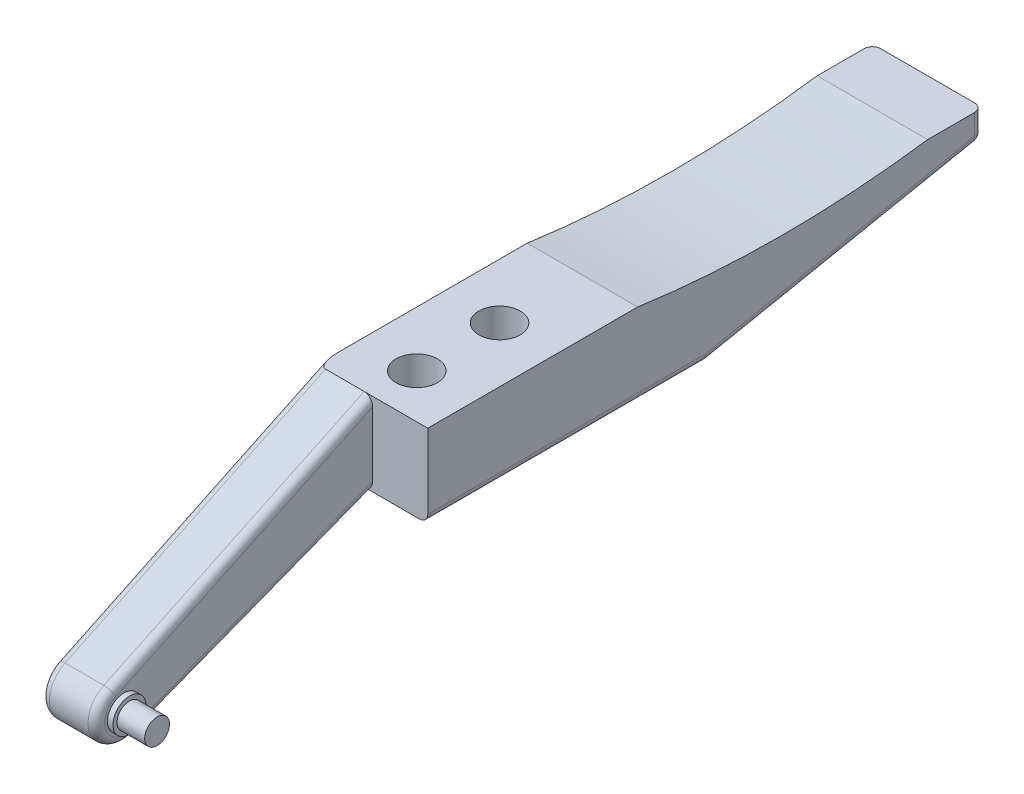
ISO-10303-21;
HEADER;
FILE_DESCRIPTION(('STEP AP214'),'2;1');
FILE_NAME('part.step','',(''),(''),'','','');
FILE_SCHEMA(('AUTOMOTIVE_DESIGN { 1 0 10303 214 1 1 1 1 }'));
ENDSEC;
DATA;
#1=APPLICATION_CONTEXT('core data for automotive mechanical design processes');
#2=APPLICATION_PROTOCOL_DEFINITION('international standard','automotive_design',2000,#1);
#3=PRODUCT_CONTEXT('',#1,'mechanical');
#4=PRODUCT('Part','Part','',(#3));
#5=PRODUCT_RELATED_PRODUCT_CATEGORY('part','',(#4));
#6=PRODUCT_DEFINITION_FORMATION('','',#4);
#7=PRODUCT_DEFINITION_CONTEXT('part definition',#1,'design');
#8=PRODUCT_DEFINITION('design','',#6,#7);
#9=PRODUCT_DEFINITION_SHAPE('','',#8);
#10=(LENGTH_UNIT() NAMED_UNIT(*) SI_UNIT(.MILLI.,.METRE.));
#11=(NAMED_UNIT(*) PLANE_ANGLE_UNIT() SI_UNIT($,.RADIAN.));
#12=(NAMED_UNIT(*) SI_UNIT($,.STERADIAN.) SOLID_ANGLE_UNIT());
#13=UNCERTAINTY_MEASURE_WITH_UNIT(LENGTH_MEASURE(1.E-05),#10,'distance_accuracy_value','');
#14=(GEOMETRIC_REPRESENTATION_CONTEXT(3) GLOBAL_UNCERTAINTY_ASSIGNED_CONTEXT((#13)) GLOBAL_UNIT_ASSIGNED_CONTEXT((#10,
#11,#12)) REPRESENTATION_CONTEXT('',''));
#15=CARTESIAN_POINT('',(0.,0.,0.));
#16=DIRECTION('',(0.,0.,1.));
#17=DIRECTION('',(1.,0.,0.));
#18=AXIS2_PLACEMENT_3D('',#15,#16,#17);
#19=CARTESIAN_POINT('',(-20.,-30.,75.));
#20=DIRECTION('',(1.,0.,0.));
#21=DIRECTION('',(0.,0.,-1.));
#22=AXIS2_PLACEMENT_3D('',#19,#20,#21);
#23=PLANE('',#22);
#24=CARTESIAN_POINT('',(-20.,-54.0121821289708,166.));
#25=DIRECTION('',(1.,0.,0.));
#26=DIRECTION('',(0.,0.,-1.));
#27=AXIS2_PLACEMENT_3D('',#24,#25,#26);
#28=CIRCLE('',#27,7.00000000000001);
#29=CARTESIAN_POINT('',(-20.,-60.542787824228,163.479843407033));
#30=VERTEX_POINT('',#29);
#31=CARTESIAN_POINT('',(-20.,-47.6942178770468,169.013855953992));
#32=VERTEX_POINT('',#31);
#33=EDGE_CURVE('E347',#30,#32,#28,.F.);
#34=ORIENTED_EDGE('',*,*,#33,.T.);
#35=DIRECTION('',(0.,0.430550850570229,-0.902566321703426));
#36=VECTOR('',#35,1.);
#37=CARTESIAN_POINT('',(-20.,-7.88031931540725,85.5517424083797));
#38=LINE('',#37,#36);
#39=CARTESIAN_POINT('',(-20.,0.,69.0321819222358));
#40=VERTEX_POINT('',#39);
#41=EDGE_CURVE('E349',#32,#40,#38,.T.);
#42=ORIENTED_EDGE('',*,*,#41,.T.);
#43=DIRECTION('',(0.,0.,-1.));
#44=VECTOR('',#43,1.);
#45=CARTESIAN_POINT('',(-20.,0.,75.));
#46=LINE('',#45,#44);
#47=CARTESIAN_POINT('',(-20.,0.,2.08166817117217E-13));
#48=VERTEX_POINT('',#47);
#49=EDGE_CURVE('E239',#40,#48,#46,.T.);
#50=ORIENTED_EDGE('',*,*,#49,.T.);
#51=CARTESIAN_POINT('',(-20.,373.93155891124,-52.4999999999999));
#52=DIRECTION('',(1.,0.,0.));
#53=DIRECTION('',(0.,0.,-1.));
#54=AXIS2_PLACEMENT_3D('',#51,#52,#53);
#55=CIRCLE('',#54,377.599074084922);
#56=CARTESIAN_POINT('',(-20.,0.,-105.));
#57=VERTEX_POINT('',#56);
#58=EDGE_CURVE('E422',#48,#57,#55,.T.);
#59=ORIENTED_EDGE('',*,*,#58,.T.);
#60=CARTESIAN_POINT('',(-20.,0.,-122.));
#61=VERTEX_POINT('',#60);
#62=EDGE_CURVE('E235',#57,#61,#46,.T.);
#63=ORIENTED_EDGE('',*,*,#62,.T.);
#64=DIRECTION('',(0.,1.,0.));
#65=VECTOR('',#64,1.);
#66=CARTESIAN_POINT('',(-20.,-10.,-122.));
#67=LINE('',#66,#65);
#68=CARTESIAN_POINT('',(-20.,-7.54058829184433,-122.));
#69=VERTEX_POINT('',#68);
#70=EDGE_CURVE('E276',#61,#69,#67,.F.);
#71=ORIENTED_EDGE('',*,*,#70,.T.);
#72=DIRECTION('',(0.,0.196116135138184,-0.98058067569092));
#73=VECTOR('',#72,1.);
#74=CARTESIAN_POINT('',(-20.,-46.2890272036965,71.7421945592607));
#75=LINE('',#74,#73);
#76=CARTESIAN_POINT('',(-20.,-27.,-24.7029414592217));
#77=VERTEX_POINT('',#76);
#78=EDGE_CURVE('E278',#69,#77,#75,.F.);
#79=ORIENTED_EDGE('',*,*,#78,.T.);
#80=DIRECTION('',(0.,0.,-1.));
#81=VECTOR('',#80,1.);
#82=CARTESIAN_POINT('',(-20.,-27.,75.));
#83=LINE('',#82,#81);
#84=CARTESIAN_POINT('',(-20.,-27.,75.));
#85=VERTEX_POINT('',#84);
#86=EDGE_CURVE('E264',#77,#85,#83,.F.);
#87=ORIENTED_EDGE('',*,*,#86,.T.);
#88=DIRECTION('',(0.,0.,-1.));
#89=VECTOR('',#88,1.);
#90=CARTESIAN_POINT('',(-20.,-27.,75.));
#91=LINE('',#90,#89);
#92=CARTESIAN_POINT('',(-20.,-27.,76.5587680218595));
#93=VERTEX_POINT('',#92);
#94=EDGE_CURVE('E338',#85,#93,#91,.F.);
#95=ORIENTED_EDGE('',*,*,#94,.T.);
#96=DIRECTION('',(0.,0.360022370423826,-0.932943670751032));
#97=VECTOR('',#96,1.);
#98=CARTESIAN_POINT('',(-20.,-60.542787824228,163.479843407033));
#99=LINE('',#98,#97);
#100=EDGE_CURVE('E345',#93,#30,#99,.F.);
#101=ORIENTED_EDGE('',*,*,#100,.T.);
#102=EDGE_LOOP('',(#34,#42,#50,#59,#63,#71,#79,#87,#95,#101));
#103=FACE_BOUND('',#102,.T.);
#104=ADVANCED_FACE('F64',(#103),#23,.F.);
#105=CARTESIAN_POINT('',(0.,-50.0121821289708,166.));
#106=DIRECTION('',(-1.,0.,0.));
#107=DIRECTION('',(0.,0.,1.));
#108=AXIS2_PLACEMENT_3D('',#105,#106,#107);
#109=PLANE('',#108);
#110=CARTESIAN_POINT('',(0.,-54.0121821289708,166.));
#111=DIRECTION('',(-1.,0.,0.));
#112=DIRECTION('',(0.,0.,1.));
#113=AXIS2_PLACEMENT_3D('',#110,#111,#112);
#114=CIRCLE('',#113,6.00000000000002);
#115=CARTESIAN_POINT('',(0.,-54.0121821289708,172.));
#116=VERTEX_POINT('',#115);
#117=EDGE_CURVE('E364',#116,#116,#114,.F.);
#118=ORIENTED_EDGE('',*,*,#117,.F.);
#119=EDGE_LOOP('',(#118));
#120=FACE_BOUND('',#119,.T.);
#121=CARTESIAN_POINT('',(0.,-54.0121821289708,166.));
#122=DIRECTION('',(-1.,0.,0.));
#123=DIRECTION('',(0.,0.,1.));
#124=AXIS2_PLACEMENT_3D('',#121,#122,#123);
#125=CIRCLE('',#124,7.00000000000001);
#126=CARTESIAN_POINT('',(0.,-47.6942178770468,169.013855953992));
#127=VERTEX_POINT('',#126);
#128=CARTESIAN_POINT('',(0.,-60.542787824228,163.479843407033));
#129=VERTEX_POINT('',#128);
#130=EDGE_CURVE('E380',#127,#129,#125,.F.);
#131=ORIENTED_EDGE('',*,*,#130,.T.);
#132=DIRECTION('',(0.,0.360022370423826,-0.932943670751032));
#133=VECTOR('',#132,1.);
#134=CARTESIAN_POINT('',(0.,-27.2011689877469,77.0800671112715));
#135=LINE('',#134,#133);
#136=CARTESIAN_POINT('',(0.,-26.7843717750023,76.));
#137=VERTEX_POINT('',#136);
#138=EDGE_CURVE('E382',#129,#137,#135,.T.);
#139=ORIENTED_EDGE('',*,*,#138,.T.);
#140=DIRECTION('',(0.,-1.,0.));
#141=VECTOR('',#140,1.);
#142=CARTESIAN_POINT('',(0.,0.,76.));
#143=LINE('',#142,#141);
#144=CARTESIAN_POINT('',(0.,-3.32385546398191,76.));
#145=VERTEX_POINT('',#144);
#146=EDGE_CURVE('E229',#145,#137,#143,.T.);
#147=ORIENTED_EDGE('',*,*,#146,.F.);
#148=DIRECTION('',(0.,0.430550850570229,-0.902566321703426));
#149=VECTOR('',#148,1.);
#150=CARTESIAN_POINT('',(0.,-46.9527217373398,167.45945316397));
#151=LINE('',#150,#149);
#152=EDGE_CURVE('E378',#145,#127,#151,.F.);
#153=ORIENTED_EDGE('',*,*,#152,.T.);
#154=EDGE_LOOP('',(#131,#139,#147,#153));
#155=FACE_BOUND('',#154,.T.);
#156=ADVANCED_FACE('F460',(#120,#155),#109,.F.);
#157=CARTESIAN_POINT('',(0.,0.,76.));
#158=DIRECTION('',(0.,0.,1.));
#159=DIRECTION('',(1.,0.,0.));
#160=AXIS2_PLACEMENT_3D('',#157,#158,#159);
#161=PLANE('',#160);
#162=DIRECTION('',(1.,0.,0.));
#163=VECTOR('',#162,1.);
#164=CARTESIAN_POINT('',(20.,0.,76.));
#165=LINE('',#164,#163);
#166=CARTESIAN_POINT('',(-3.,0.,76.));
#167=VERTEX_POINT('',#166);
#168=CARTESIAN_POINT('',(20.,0.,76.));
#169=VERTEX_POINT('',#168);
#170=EDGE_CURVE('E207',#167,#169,#165,.T.);
#171=ORIENTED_EDGE('',*,*,#170,.F.);
#172=CARTESIAN_POINT('',(-3.,-3.32385546398192,76.));
#173=DIRECTION('',(0.,0.,1.));
#174=DIRECTION('',(0.,1.,0.));
#175=AXIS2_PLACEMENT_3D('',#172,#173,#174);
#176=ELLIPSE('',#175,3.32385546398192,3.);
#177=EDGE_CURVE('E12',#167,#145,#176,.F.);
#178=ORIENTED_EDGE('',*,*,#177,.T.);
#179=ORIENTED_EDGE('',*,*,#146,.T.);
#180=CARTESIAN_POINT('',(-3.,-26.7843717750023,76.));
#181=DIRECTION('',(0.,0.,1.));
#182=DIRECTION('',(0.,-1.,0.));
#183=AXIS2_PLACEMENT_3D('',#180,#181,#182);
#184=ELLIPSE('',#183,3.21562822499772,3.);
#185=CARTESIAN_POINT('',(-3.,-30.,76.));
#186=VERTEX_POINT('',#185);
#187=EDGE_CURVE('E74',#137,#186,#184,.F.);
#188=ORIENTED_EDGE('',*,*,#187,.T.);
#189=DIRECTION('',(1.,0.,0.));
#190=VECTOR('',#189,1.);
#191=CARTESIAN_POINT('',(20.,-30.,76.));
#192=LINE('',#191,#190);
#193=CARTESIAN_POINT('',(17.,-30.,76.));
#194=VERTEX_POINT('',#193);
#195=EDGE_CURVE('E81',#186,#194,#192,.T.);
#196=ORIENTED_EDGE('',*,*,#195,.T.);
#197=CARTESIAN_POINT('',(17.,-27.,76.));
#198=DIRECTION('',(0.,0.,1.));
#199=DIRECTION('',(1.,0.,0.));
#200=AXIS2_PLACEMENT_3D('',#197,#198,#199);
#201=CIRCLE('',#200,3.);
#202=CARTESIAN_POINT('',(20.,-27.,76.));
#203=VERTEX_POINT('',#202);
#204=EDGE_CURVE('E225',#194,#203,#201,.T.);
#205=ORIENTED_EDGE('',*,*,#204,.T.);
#206=DIRECTION('',(0.,-1.,0.));
#207=VECTOR('',#206,1.);
#208=CARTESIAN_POINT('',(20.,-60.,76.));
#209=LINE('',#208,#207);
#210=EDGE_CURVE('E220',#169,#203,#209,.T.);
#211=ORIENTED_EDGE('',*,*,#210,.F.);
#212=EDGE_LOOP('',(#171,#178,#179,#188,#196,#205,#211));
#213=FACE_BOUND('',#212,.T.);
#214=ADVANCED_FACE('F223',(#213),#161,.T.);
#215=CARTESIAN_POINT('',(0.,0.,0.));
#216=DIRECTION('',(0.,1.,0.));
#217=DIRECTION('',(0.,0.,1.));
#218=AXIS2_PLACEMENT_3D('',#215,#216,#217);
#219=PLANE('',#218);
#220=CARTESIAN_POINT('',(0.,0.,60.));
#221=DIRECTION('',(0.,1.,0.));
#222=DIRECTION('',(0.,0.,1.));
#223=AXIS2_PLACEMENT_3D('',#220,#221,#222);
#224=CIRCLE('',#223,7.5);
#225=CARTESIAN_POINT('',(0.,0.,67.5));
#226=VERTEX_POINT('',#225);
#227=EDGE_CURVE('E242',#226,#226,#224,.T.);
#228=ORIENTED_EDGE('',*,*,#227,.F.);
#229=EDGE_LOOP('',(#228));
#230=FACE_BOUND('',#229,.T.);
#231=CARTESIAN_POINT('',(0.,0.,30.));
#232=DIRECTION('',(0.,1.,0.));
#233=DIRECTION('',(0.,0.,1.));
#234=AXIS2_PLACEMENT_3D('',#231,#232,#233);
#235=CIRCLE('',#234,7.5);
#236=CARTESIAN_POINT('',(0.,0.,37.5));
#237=VERTEX_POINT('',#236);
#238=EDGE_CURVE('E244',#237,#237,#235,.T.);
#239=ORIENTED_EDGE('',*,*,#238,.F.);
#240=EDGE_LOOP('',(#239));
#241=FACE_BOUND('',#240,.T.);
#242=ORIENTED_EDGE('',*,*,#49,.F.);
#243=CARTESIAN_POINT('',(-17.,0.,69.0321819222358));
#244=DIRECTION('',(0.,1.,0.));
#245=DIRECTION('',(0.,0.,-1.));
#246=AXIS2_PLACEMENT_3D('',#243,#244,#245);
#247=ELLIPSE('',#246,6.96781807776421,3.);
#248=CARTESIAN_POINT('',(-17.,0.,76.));
#249=VERTEX_POINT('',#248);
#250=EDGE_CURVE('E352',#40,#249,#247,.T.);
#251=ORIENTED_EDGE('',*,*,#250,.T.);
#252=EDGE_CURVE('E216',#249,#167,#165,.T.);
#253=ORIENTED_EDGE('',*,*,#252,.T.);
#254=ORIENTED_EDGE('',*,*,#170,.T.);
#255=DIRECTION('',(0.,0.,-1.));
#256=VECTOR('',#255,1.);
#257=CARTESIAN_POINT('',(20.,0.,75.));
#258=LINE('',#257,#256);
#259=CARTESIAN_POINT('',(20.,0.,2.08166817117217E-13));
#260=VERTEX_POINT('',#259);
#261=EDGE_CURVE('E213',#169,#260,#258,.T.);
#262=ORIENTED_EDGE('',*,*,#261,.T.);
#263=DIRECTION('',(1.,0.,0.));
#264=VECTOR('',#263,1.);
#265=CARTESIAN_POINT('',(-30.,0.,2.08166817117217E-13));
#266=LINE('',#265,#264);
#267=EDGE_CURVE('E255',#48,#260,#266,.T.);
#268=ORIENTED_EDGE('',*,*,#267,.F.);
#269=EDGE_LOOP('',(#242,#251,#253,#254,#262,#268));
#270=FACE_BOUND('',#269,.T.);
#271=ADVANCED_FACE('F210',(#230,#241,#270),#219,.T.);
#272=CARTESIAN_POINT('',(20.,-30.,75.));
#273=DIRECTION('',(1.,0.,0.));
#274=DIRECTION('',(0.,0.,-1.));
#275=AXIS2_PLACEMENT_3D('',#272,#273,#274);
#276=PLANE('',#275);
#277=ORIENTED_EDGE('',*,*,#210,.T.);
#278=DIRECTION('',(0.,0.,-1.));
#279=VECTOR('',#278,1.);
#280=CARTESIAN_POINT('',(20.,-27.,75.));
#281=LINE('',#280,#279);
#282=CARTESIAN_POINT('',(20.,-27.,75.));
#283=VERTEX_POINT('',#282);
#284=EDGE_CURVE('E340',#203,#283,#281,.T.);
#285=ORIENTED_EDGE('',*,*,#284,.T.);
#286=DIRECTION('',(0.,0.,-1.));
#287=VECTOR('',#286,1.);
#288=CARTESIAN_POINT('',(20.,-27.,-25.));
#289=LINE('',#288,#287);
#290=CARTESIAN_POINT('',(20.,-27.,-24.7029414592217));
#291=VERTEX_POINT('',#290);
#292=EDGE_CURVE('E257',#283,#291,#289,.T.);
#293=ORIENTED_EDGE('',*,*,#292,.T.);
#294=DIRECTION('',(0.,-0.196116135138184,0.98058067569092));
#295=VECTOR('',#294,1.);
#296=CARTESIAN_POINT('',(20.,-7.05825797292724,-124.411651594585));
#297=LINE('',#296,#295);
#298=CARTESIAN_POINT('',(20.,-7.54058829184433,-122.));
#299=VERTEX_POINT('',#298);
#300=EDGE_CURVE('E299',#291,#299,#297,.F.);
#301=ORIENTED_EDGE('',*,*,#300,.T.);
#302=DIRECTION('',(0.,-1.,0.));
#303=VECTOR('',#302,1.);
#304=CARTESIAN_POINT('',(20.,-30.,-122.));
#305=LINE('',#304,#303);
#306=CARTESIAN_POINT('',(20.,0.,-122.));
#307=VERTEX_POINT('',#306);
#308=EDGE_CURVE('E301',#299,#307,#305,.F.);
#309=ORIENTED_EDGE('',*,*,#308,.T.);
#310=CARTESIAN_POINT('',(20.,0.,-105.));
#311=VERTEX_POINT('',#310);
#312=EDGE_CURVE('E236',#311,#307,#258,.T.);
#313=ORIENTED_EDGE('',*,*,#312,.F.);
#314=CARTESIAN_POINT('',(20.,373.93155891124,-52.4999999999999));
#315=DIRECTION('',(1.,0.,0.));
#316=DIRECTION('',(0.,0.,-1.));
#317=AXIS2_PLACEMENT_3D('',#314,#315,#316);
#318=CIRCLE('',#317,377.599074084922);
#319=EDGE_CURVE('E234',#260,#311,#318,.T.);
#320=ORIENTED_EDGE('',*,*,#319,.F.);
#321=ORIENTED_EDGE('',*,*,#261,.F.);
#322=EDGE_LOOP('',(#277,#285,#293,#301,#309,#313,#320,#321));
#323=FACE_BOUND('',#322,.T.);
#324=ADVANCED_FACE('F232',(#323),#276,.T.);
#325=CARTESIAN_POINT('',(0.,-30.,0.));
#326=DIRECTION('',(0.,1.,0.));
#327=DIRECTION('',(0.,0.,1.));
#328=AXIS2_PLACEMENT_3D('',#325,#326,#327);
#329=PLANE('',#328);
#330=CARTESIAN_POINT('',(0.,-30.,30.));
#331=DIRECTION('',(0.,-1.,0.));
#332=DIRECTION('',(0.,0.,-1.));
#333=AXIS2_PLACEMENT_3D('',#330,#331,#332);
#334=CIRCLE('',#333,6.);
#335=CARTESIAN_POINT('',(0.,-30.,24.));
#336=VERTEX_POINT('',#335);
#337=EDGE_CURVE('E425',#336,#336,#334,.T.);
#338=ORIENTED_EDGE('',*,*,#337,.F.);
#339=EDGE_LOOP('',(#338));
#340=FACE_BOUND('',#339,.T.);
#341=CARTESIAN_POINT('',(0.,-30.,60.));
#342=DIRECTION('',(0.,-1.,0.));
#343=DIRECTION('',(0.,0.,-1.));
#344=AXIS2_PLACEMENT_3D('',#341,#342,#343);
#345=CIRCLE('',#344,6.);
#346=CARTESIAN_POINT('',(0.,-30.,54.));
#347=VERTEX_POINT('',#346);
#348=EDGE_CURVE('E429',#347,#347,#345,.T.);
#349=ORIENTED_EDGE('',*,*,#348,.F.);
#350=EDGE_LOOP('',(#349));
#351=FACE_BOUND('',#350,.T.);
#352=DIRECTION('',(0.,0.,-1.));
#353=VECTOR('',#352,1.);
#354=CARTESIAN_POINT('',(17.,-30.,135.));
#355=LINE('',#354,#353);
#356=CARTESIAN_POINT('',(17.,-30.,-24.7029414592216));
#357=VERTEX_POINT('',#356);
#358=CARTESIAN_POINT('',(17.,-30.,75.));
#359=VERTEX_POINT('',#358);
#360=EDGE_CURVE('E261',#357,#359,#355,.F.);
#361=ORIENTED_EDGE('',*,*,#360,.T.);
#362=DIRECTION('',(0.,0.,-1.));
#363=VECTOR('',#362,1.);
#364=CARTESIAN_POINT('',(17.,-30.,76.));
#365=LINE('',#364,#363);
#366=EDGE_CURVE('E342',#359,#194,#365,.F.);
#367=ORIENTED_EDGE('',*,*,#366,.T.);
#368=ORIENTED_EDGE('',*,*,#195,.F.);
#369=CARTESIAN_POINT('',(-17.,-30.,76.));
#370=VERTEX_POINT('',#369);
#371=EDGE_CURVE('E418',#370,#186,#192,.T.);
#372=ORIENTED_EDGE('',*,*,#371,.F.);
#373=DIRECTION('',(0.,0.,-1.));
#374=VECTOR('',#373,1.);
#375=CARTESIAN_POINT('',(-17.,-30.,0.));
#376=LINE('',#375,#374);
#377=CARTESIAN_POINT('',(-17.,-30.,75.));
#378=VERTEX_POINT('',#377);
#379=EDGE_CURVE('E335',#370,#378,#376,.T.);
#380=ORIENTED_EDGE('',*,*,#379,.T.);
#381=DIRECTION('',(0.,0.,-1.));
#382=VECTOR('',#381,1.);
#383=CARTESIAN_POINT('',(-17.,-30.,0.));
#384=LINE('',#383,#382);
#385=CARTESIAN_POINT('',(-17.,-30.,-24.7029414592217));
#386=VERTEX_POINT('',#385);
#387=EDGE_CURVE('E259',#378,#386,#384,.T.);
#388=ORIENTED_EDGE('',*,*,#387,.T.);
#389=DIRECTION('',(-1.,0.,0.));
#390=VECTOR('',#389,1.);
#391=CARTESIAN_POINT('',(0.,-30.,-24.7029414592217));
#392=LINE('',#391,#390);
#393=EDGE_CURVE('E284',#386,#357,#392,.F.);
#394=ORIENTED_EDGE('',*,*,#393,.T.);
#395=EDGE_LOOP('',(#361,#367,#368,#372,#380,#388,#394));
#396=FACE_BOUND('',#395,.T.);
#397=ADVANCED_FACE('F457',(#340,#351,#396),#329,.F.);
#398=CARTESIAN_POINT('',(17.,-27.,75.));
#399=DIRECTION('',(0.,0.,1.));
#400=DIRECTION('',(1.,0.,0.));
#401=AXIS2_PLACEMENT_3D('',#398,#399,#400);
#402=CYLINDRICAL_SURFACE('',#401,3.);
#403=ORIENTED_EDGE('',*,*,#292,.F.);
#404=CARTESIAN_POINT('',(17.,-27.,75.));
#405=DIRECTION('',(0.,0.,1.));
#406=DIRECTION('',(1.,0.,0.));
#407=AXIS2_PLACEMENT_3D('',#404,#405,#406);
#408=CIRCLE('',#407,3.);
#409=EDGE_CURVE('E307',#283,#359,#408,.F.);
#410=ORIENTED_EDGE('',*,*,#409,.T.);
#411=ORIENTED_EDGE('',*,*,#360,.F.);
#412=CARTESIAN_POINT('',(17.,-27.,-24.7029414592217));
#413=DIRECTION('',(0.,0.,1.));
#414=DIRECTION('',(1.,0.,0.));
#415=AXIS2_PLACEMENT_3D('',#412,#413,#414);
#416=CIRCLE('',#415,3.);
#417=EDGE_CURVE('E286',#357,#291,#416,.T.);
#418=ORIENTED_EDGE('',*,*,#417,.T.);
#419=EDGE_LOOP('',(#403,#410,#411,#418));
#420=FACE_BOUND('',#419,.T.);
#421=ADVANCED_FACE('F477',(#420),#402,.T.);
#422=CARTESIAN_POINT('',(-17.,-27.,0.));
#423=DIRECTION('',(0.,0.,-1.));
#424=DIRECTION('',(-1.,0.,0.));
#425=AXIS2_PLACEMENT_3D('',#422,#423,#424);
#426=CYLINDRICAL_SURFACE('',#425,3.);
#427=ORIENTED_EDGE('',*,*,#387,.F.);
#428=CARTESIAN_POINT('',(-17.,-27.,75.));
#429=DIRECTION('',(0.,0.,1.));
#430=DIRECTION('',(1.,0.,0.));
#431=AXIS2_PLACEMENT_3D('',#428,#429,#430);
#432=CIRCLE('',#431,3.);
#433=EDGE_CURVE('E303',#378,#85,#432,.F.);
#434=ORIENTED_EDGE('',*,*,#433,.T.);
#435=ORIENTED_EDGE('',*,*,#86,.F.);
#436=CARTESIAN_POINT('',(-17.,-27.,-24.7029414592217));
#437=DIRECTION('',(0.,0.,-1.));
#438=DIRECTION('',(-1.,0.,0.));
#439=AXIS2_PLACEMENT_3D('',#436,#437,#438);
#440=CIRCLE('',#439,3.);
#441=EDGE_CURVE('E281',#77,#386,#440,.F.);
#442=ORIENTED_EDGE('',*,*,#441,.T.);
#443=EDGE_LOOP('',(#427,#434,#435,#442));
#444=FACE_BOUND('',#443,.T.);
#445=ADVANCED_FACE('F480',(#444),#426,.T.);
#446=CARTESIAN_POINT('',(0.,-30.,30.));
#447=DIRECTION('',(0.,1.,0.));
#448=DIRECTION('',(0.,0.,1.));
#449=AXIS2_PLACEMENT_3D('',#446,#447,#448);
#450=CYLINDRICAL_SURFACE('',#449,7.5);
#451=ORIENTED_EDGE('',*,*,#238,.T.);
#452=EDGE_LOOP('',(#451));
#453=FACE_BOUND('',#452,.T.);
#454=CARTESIAN_POINT('',(0.,-25.,30.));
#455=DIRECTION('',(0.,-1.,0.));
#456=DIRECTION('',(0.,0.,-1.));
#457=AXIS2_PLACEMENT_3D('',#454,#455,#456);
#458=CIRCLE('',#457,7.5);
#459=CARTESIAN_POINT('',(0.,-25.,22.5));
#460=VERTEX_POINT('',#459);
#461=EDGE_CURVE('E250',#460,#460,#458,.F.);
#462=ORIENTED_EDGE('',*,*,#461,.F.);
#463=EDGE_LOOP('',(#462));
#464=FACE_BOUND('',#463,.T.);
#465=ADVANCED_FACE('F445',(#453,#464),#450,.F.);
#466=CARTESIAN_POINT('',(0.,-30.,60.));
#467=DIRECTION('',(0.,1.,0.));
#468=DIRECTION('',(0.,0.,1.));
#469=AXIS2_PLACEMENT_3D('',#466,#467,#468);
#470=CYLINDRICAL_SURFACE('',#469,7.5);
#471=ORIENTED_EDGE('',*,*,#227,.T.);
#472=EDGE_LOOP('',(#471));
#473=FACE_BOUND('',#472,.T.);
#474=CARTESIAN_POINT('',(0.,-25.,60.));
#475=DIRECTION('',(0.,-1.,0.));
#476=DIRECTION('',(0.,0.,-1.));
#477=AXIS2_PLACEMENT_3D('',#474,#475,#476);
#478=CIRCLE('',#477,7.5);
#479=CARTESIAN_POINT('',(0.,-25.,52.5));
#480=VERTEX_POINT('',#479);
#481=EDGE_CURVE('E247',#480,#480,#478,.F.);
#482=ORIENTED_EDGE('',*,*,#481,.F.);
#483=EDGE_LOOP('',(#482));
#484=FACE_BOUND('',#483,.T.);
#485=ADVANCED_FACE('F466',(#473,#484),#470,.F.);
#486=DIRECTION('',(1.,0.,0.));
#487=VECTOR('',#486,1.);
#488=CARTESIAN_POINT('',(20.,0.,-125.));
#489=LINE('',#488,#487);
#490=CARTESIAN_POINT('',(-17.,0.,-125.));
#491=VERTEX_POINT('',#490);
#492=CARTESIAN_POINT('',(17.,0.,-125.));
#493=VERTEX_POINT('',#492);
#494=EDGE_CURVE('E435',#491,#493,#489,.T.);
#495=ORIENTED_EDGE('',*,*,#494,.F.);
#496=CARTESIAN_POINT('',(-17.,0.,-122.));
#497=DIRECTION('',(0.,1.,0.));
#498=DIRECTION('',(0.,0.,1.));
#499=AXIS2_PLACEMENT_3D('',#496,#497,#498);
#500=CIRCLE('',#499,3.);
#501=EDGE_CURVE('E297',#491,#61,#500,.T.);
#502=ORIENTED_EDGE('',*,*,#501,.T.);
#503=ORIENTED_EDGE('',*,*,#62,.F.);
#504=DIRECTION('',(1.,0.,0.));
#505=VECTOR('',#504,1.);
#506=CARTESIAN_POINT('',(-30.,0.,-105.));
#507=LINE('',#506,#505);
#508=EDGE_CURVE('E253',#311,#57,#507,.F.);
#509=ORIENTED_EDGE('',*,*,#508,.F.);
#510=ORIENTED_EDGE('',*,*,#312,.T.);
#511=CARTESIAN_POINT('',(17.,0.,-122.));
#512=DIRECTION('',(0.,1.,0.));
#513=DIRECTION('',(0.,0.,1.));
#514=AXIS2_PLACEMENT_3D('',#511,#512,#513);
#515=CIRCLE('',#514,3.);
#516=EDGE_CURVE('E295',#307,#493,#515,.T.);
#517=ORIENTED_EDGE('',*,*,#516,.T.);
#518=EDGE_LOOP('',(#495,#502,#503,#509,#510,#517));
#519=FACE_BOUND('',#518,.T.);
#520=ADVANCED_FACE('F451',(#519),#219,.T.);
#521=CARTESIAN_POINT('',(0.,0.,-125.));
#522=DIRECTION('',(0.,0.,-1.));
#523=DIRECTION('',(-1.,0.,0.));
#524=AXIS2_PLACEMENT_3D('',#521,#522,#523);
#525=PLANE('',#524);
#526=DIRECTION('',(1.,0.,0.));
#527=VECTOR('',#526,1.);
#528=CARTESIAN_POINT('',(-20.,-7.54058829184433,-125.));
#529=LINE('',#528,#527);
#530=CARTESIAN_POINT('',(17.,-7.54058829184433,-125.));
#531=VERTEX_POINT('',#530);
#532=CARTESIAN_POINT('',(-17.,-7.54058829184433,-125.));
#533=VERTEX_POINT('',#532);
#534=EDGE_CURVE('E289',#531,#533,#529,.F.);
#535=ORIENTED_EDGE('',*,*,#534,.T.);
#536=DIRECTION('',(0.,1.,0.));
#537=VECTOR('',#536,1.);
#538=CARTESIAN_POINT('',(-17.,0.,-125.));
#539=LINE('',#538,#537);
#540=EDGE_CURVE('E293',#533,#491,#539,.T.);
#541=ORIENTED_EDGE('',*,*,#540,.T.);
#542=ORIENTED_EDGE('',*,*,#494,.T.);
#543=DIRECTION('',(0.,-1.,0.));
#544=VECTOR('',#543,1.);
#545=CARTESIAN_POINT('',(17.,0.,-125.));
#546=LINE('',#545,#544);
#547=EDGE_CURVE('E291',#493,#531,#546,.T.);
#548=ORIENTED_EDGE('',*,*,#547,.T.);
#549=EDGE_LOOP('',(#535,#541,#542,#548));
#550=FACE_BOUND('',#549,.T.);
#551=ADVANCED_FACE('F465',(#550),#525,.T.);
#552=CARTESIAN_POINT('',(30.,-10.,-125.));
#553=DIRECTION('',(0.,0.98058067569092,0.196116135138184));
#554=DIRECTION('',(0.,-0.196116135138184,0.98058067569092));
#555=AXIS2_PLACEMENT_3D('',#552,#553,#554);
#556=PLANE('',#555);
#557=DIRECTION('',(-1.,0.,0.));
#558=VECTOR('',#557,1.);
#559=CARTESIAN_POINT('',(30.,-29.9417420270728,-25.2912898646362));
#560=LINE('',#559,#558);
#561=CARTESIAN_POINT('',(17.,-29.9417420270728,-25.2912898646362));
#562=VERTEX_POINT('',#561);
#563=CARTESIAN_POINT('',(-17.,-29.9417420270728,-25.2912898646362));
#564=VERTEX_POINT('',#563);
#565=EDGE_CURVE('E271',#562,#564,#560,.T.);
#566=ORIENTED_EDGE('',*,*,#565,.T.);
#567=DIRECTION('',(0.,0.196116135138184,-0.98058067569092));
#568=VECTOR('',#567,1.);
#569=CARTESIAN_POINT('',(-17.,-10.,-125.));
#570=LINE('',#569,#568);
#571=CARTESIAN_POINT('',(-17.,-10.4823303189171,-122.588348405415));
#572=VERTEX_POINT('',#571);
#573=EDGE_CURVE('E273',#564,#572,#570,.T.);
#574=ORIENTED_EDGE('',*,*,#573,.T.);
#575=DIRECTION('',(1.,0.,0.));
#576=VECTOR('',#575,1.);
#577=CARTESIAN_POINT('',(20.,-10.4823303189171,-122.588348405415));
#578=LINE('',#577,#576);
#579=CARTESIAN_POINT('',(17.,-10.4823303189171,-122.588348405415));
#580=VERTEX_POINT('',#579);
#581=EDGE_CURVE('E269',#572,#580,#578,.T.);
#582=ORIENTED_EDGE('',*,*,#581,.T.);
#583=DIRECTION('',(0.,-0.196116135138184,0.98058067569092));
#584=VECTOR('',#583,1.);
#585=CARTESIAN_POINT('',(17.,-27.,-40.));
#586=LINE('',#585,#584);
#587=EDGE_CURVE('E267',#580,#562,#586,.T.);
#588=ORIENTED_EDGE('',*,*,#587,.T.);
#589=EDGE_LOOP('',(#566,#574,#582,#588));
#590=FACE_BOUND('',#589,.T.);
#591=ADVANCED_FACE('F582',(#590),#556,.F.);
#592=CARTESIAN_POINT('',(0.,-25.,60.));
#593=DIRECTION('',(0.,-1.,0.));
#594=DIRECTION('',(0.,0.,-1.));
#595=AXIS2_PLACEMENT_3D('',#592,#593,#594);
#596=PLANE('',#595);
#597=CARTESIAN_POINT('',(0.,-25.,60.));
#598=DIRECTION('',(0.,-1.,0.));
#599=DIRECTION('',(0.,0.,-1.));
#600=AXIS2_PLACEMENT_3D('',#597,#598,#599);
#601=CIRCLE('',#600,6.);
#602=CARTESIAN_POINT('',(0.,-25.,54.));
#603=VERTEX_POINT('',#602);
#604=EDGE_CURVE('E432',#603,#603,#601,.T.);
#605=ORIENTED_EDGE('',*,*,#604,.T.);
#606=EDGE_LOOP('',(#605));
#607=FACE_BOUND('',#606,.T.);
#608=ORIENTED_EDGE('',*,*,#481,.T.);
#609=EDGE_LOOP('',(#608));
#610=FACE_BOUND('',#609,.T.);
#611=ADVANCED_FACE('F648',(#607,#610),#596,.F.);
#612=CARTESIAN_POINT('',(0.,-25.,60.));
#613=DIRECTION('',(0.,-1.,0.));
#614=DIRECTION('',(0.,0.,-1.));
#615=AXIS2_PLACEMENT_3D('',#612,#613,#614);
#616=CYLINDRICAL_SURFACE('',#615,6.);
#617=ORIENTED_EDGE('',*,*,#604,.F.);
#618=EDGE_LOOP('',(#617));
#619=FACE_BOUND('',#618,.T.);
#620=ORIENTED_EDGE('',*,*,#348,.T.);
#621=EDGE_LOOP('',(#620));
#622=FACE_BOUND('',#621,.T.);
#623=ADVANCED_FACE('F644',(#619,#622),#616,.F.);
#624=CARTESIAN_POINT('',(0.,-25.,30.));
#625=DIRECTION('',(0.,-1.,0.));
#626=DIRECTION('',(0.,0.,-1.));
#627=AXIS2_PLACEMENT_3D('',#624,#625,#626);
#628=PLANE('',#627);
#629=CARTESIAN_POINT('',(0.,-25.,30.));
#630=DIRECTION('',(0.,-1.,0.));
#631=DIRECTION('',(0.,0.,-1.));
#632=AXIS2_PLACEMENT_3D('',#629,#630,#631);
#633=CIRCLE('',#632,6.);
#634=CARTESIAN_POINT('',(0.,-25.,24.));
#635=VERTEX_POINT('',#634);
#636=EDGE_CURVE('E426',#635,#635,#633,.T.);
#637=ORIENTED_EDGE('',*,*,#636,.T.);
#638=EDGE_LOOP('',(#637));
#639=FACE_BOUND('',#638,.T.);
#640=ORIENTED_EDGE('',*,*,#461,.T.);
#641=EDGE_LOOP('',(#640));
#642=FACE_BOUND('',#641,.T.);
#643=ADVANCED_FACE('F640',(#639,#642),#628,.F.);
#644=CARTESIAN_POINT('',(0.,-25.,30.));
#645=DIRECTION('',(0.,-1.,0.));
#646=DIRECTION('',(0.,0.,-1.));
#647=AXIS2_PLACEMENT_3D('',#644,#645,#646);
#648=CYLINDRICAL_SURFACE('',#647,6.);
#649=ORIENTED_EDGE('',*,*,#636,.F.);
#650=EDGE_LOOP('',(#649));
#651=FACE_BOUND('',#650,.T.);
#652=ORIENTED_EDGE('',*,*,#337,.T.);
#653=EDGE_LOOP('',(#652));
#654=FACE_BOUND('',#653,.T.);
#655=ADVANCED_FACE('F637',(#651,#654),#648,.F.);
#656=CARTESIAN_POINT('',(-30.,373.93155891124,-52.4999999999999));
#657=DIRECTION('',(1.,0.,0.));
#658=DIRECTION('',(0.,0.,-1.));
#659=AXIS2_PLACEMENT_3D('',#656,#657,#658);
#660=CYLINDRICAL_SURFACE('',#659,377.599074084922);
#661=ORIENTED_EDGE('',*,*,#267,.T.);
#662=ORIENTED_EDGE('',*,*,#319,.T.);
#663=ORIENTED_EDGE('',*,*,#508,.T.);
#664=ORIENTED_EDGE('',*,*,#58,.F.);
#665=EDGE_LOOP('',(#661,#662,#663,#664));
#666=FACE_BOUND('',#665,.T.);
#667=ADVANCED_FACE('F525',(#666),#660,.F.);
#668=CARTESIAN_POINT('',(17.,-7.05825797292724,-124.411651594585));
#669=DIRECTION('',(0.,0.196116135138184,-0.98058067569092));
#670=DIRECTION('',(0.,0.98058067569092,0.196116135138184));
#671=AXIS2_PLACEMENT_3D('',#668,#669,#670);
#672=CYLINDRICAL_SURFACE('',#671,3.);
#673=CARTESIAN_POINT('',(17.,-7.54058829184433,-122.));
#674=DIRECTION('',(0.,0.196116135138184,-0.98058067569092));
#675=DIRECTION('',(0.,0.98058067569092,0.196116135138184));
#676=AXIS2_PLACEMENT_3D('',#673,#674,#675);
#677=CIRCLE('',#676,3.);
#678=EDGE_CURVE('E327',#299,#580,#677,.T.);
#679=ORIENTED_EDGE('',*,*,#678,.F.);
#680=ORIENTED_EDGE('',*,*,#300,.F.);
#681=CARTESIAN_POINT('',(17.,-27.,-24.7029414592217));
#682=DIRECTION('',(0.,-0.196116135138184,0.98058067569092));
#683=DIRECTION('',(0.,-0.98058067569092,-0.196116135138184));
#684=AXIS2_PLACEMENT_3D('',#681,#682,#683);
#685=CIRCLE('',#684,3.);
#686=EDGE_CURVE('E330',#562,#291,#685,.T.);
#687=ORIENTED_EDGE('',*,*,#686,.F.);
#688=ORIENTED_EDGE('',*,*,#587,.F.);
#689=EDGE_LOOP('',(#679,#680,#687,#688));
#690=FACE_BOUND('',#689,.T.);
#691=ADVANCED_FACE('F521',(#690),#672,.T.);
#692=CARTESIAN_POINT('',(17.,0.,-122.));
#693=DIRECTION('',(0.,-1.,0.));
#694=DIRECTION('',(0.,0.,-1.));
#695=AXIS2_PLACEMENT_3D('',#692,#693,#694);
#696=CYLINDRICAL_SURFACE('',#695,3.);
#697=ORIENTED_EDGE('',*,*,#516,.F.);
#698=ORIENTED_EDGE('',*,*,#308,.F.);
#699=CARTESIAN_POINT('',(17.,-7.54058829184433,-122.));
#700=DIRECTION('',(0.,-1.,0.));
#701=DIRECTION('',(0.,0.,-1.));
#702=AXIS2_PLACEMENT_3D('',#699,#700,#701);
#703=CIRCLE('',#702,3.);
#704=EDGE_CURVE('E324',#531,#299,#703,.T.);
#705=ORIENTED_EDGE('',*,*,#704,.F.);
#706=ORIENTED_EDGE('',*,*,#547,.F.);
#707=EDGE_LOOP('',(#697,#698,#705,#706));
#708=FACE_BOUND('',#707,.T.);
#709=ADVANCED_FACE('F517',(#708),#696,.T.);
#710=CARTESIAN_POINT('',(17.,-27.,-24.7029414592217));
#711=DIRECTION('',(0.,0.98058067569092,0.196116135138184));
#712=DIRECTION('',(0.,-0.196116135138184,0.98058067569092));
#713=AXIS2_PLACEMENT_3D('',#710,#711,#712);
#714=SPHERICAL_SURFACE('',#713,3.);
#715=ORIENTED_EDGE('',*,*,#686,.T.);
#716=ORIENTED_EDGE('',*,*,#417,.F.);
#717=CARTESIAN_POINT('',(17.,-27.,-24.7029414592217));
#718=DIRECTION('',(-1.,0.,0.));
#719=DIRECTION('',(0.,0.,1.));
#720=AXIS2_PLACEMENT_3D('',#717,#718,#719);
#721=CIRCLE('',#720,3.);
#722=EDGE_CURVE('E321',#562,#357,#721,.T.);
#723=ORIENTED_EDGE('',*,*,#722,.F.);
#724=EDGE_LOOP('',(#715,#716,#723));
#725=FACE_BOUND('',#724,.T.);
#726=ADVANCED_FACE('F513',(#725),#714,.T.);
#727=CARTESIAN_POINT('',(17.,-7.54058829184433,-122.));
#728=DIRECTION('',(0.,0.,1.));
#729=DIRECTION('',(1.,0.,0.));
#730=AXIS2_PLACEMENT_3D('',#727,#728,#729);
#731=SPHERICAL_SURFACE('',#730,3.);
#732=ORIENTED_EDGE('',*,*,#704,.T.);
#733=ORIENTED_EDGE('',*,*,#678,.T.);
#734=CARTESIAN_POINT('',(17.,-7.54058829184433,-122.));
#735=DIRECTION('',(1.,0.,0.));
#736=DIRECTION('',(0.,0.,-1.));
#737=AXIS2_PLACEMENT_3D('',#734,#735,#736);
#738=CIRCLE('',#737,3.);
#739=EDGE_CURVE('E318',#531,#580,#738,.F.);
#740=ORIENTED_EDGE('',*,*,#739,.F.);
#741=EDGE_LOOP('',(#732,#733,#740));
#742=FACE_BOUND('',#741,.T.);
#743=ADVANCED_FACE('F509',(#742),#731,.T.);
#744=CARTESIAN_POINT('',(30.,-27.,-24.7029414592217));
#745=DIRECTION('',(-1.,0.,0.));
#746=DIRECTION('',(0.,0.,1.));
#747=AXIS2_PLACEMENT_3D('',#744,#745,#746);
#748=CYLINDRICAL_SURFACE('',#747,3.);
#749=ORIENTED_EDGE('',*,*,#722,.T.);
#750=ORIENTED_EDGE('',*,*,#393,.F.);
#751=CARTESIAN_POINT('',(-17.,-27.,-24.7029414592217));
#752=DIRECTION('',(-1.,0.,0.));
#753=DIRECTION('',(0.,0.,1.));
#754=AXIS2_PLACEMENT_3D('',#751,#752,#753);
#755=CIRCLE('',#754,3.);
#756=EDGE_CURVE('E315',#564,#386,#755,.T.);
#757=ORIENTED_EDGE('',*,*,#756,.F.);
#758=ORIENTED_EDGE('',*,*,#565,.F.);
#759=EDGE_LOOP('',(#749,#750,#757,#758));
#760=FACE_BOUND('',#759,.T.);
#761=ADVANCED_FACE('F505',(#760),#748,.T.);
#762=CARTESIAN_POINT('',(30.,-7.54058829184433,-122.));
#763=DIRECTION('',(-1.,0.,0.));
#764=DIRECTION('',(0.,0.,1.));
#765=AXIS2_PLACEMENT_3D('',#762,#763,#764);
#766=CYLINDRICAL_SURFACE('',#765,3.);
#767=ORIENTED_EDGE('',*,*,#739,.T.);
#768=ORIENTED_EDGE('',*,*,#581,.F.);
#769=CARTESIAN_POINT('',(-17.,-7.54058829184433,-122.));
#770=DIRECTION('',(-1.,0.,0.));
#771=DIRECTION('',(0.,-1.,0.));
#772=AXIS2_PLACEMENT_3D('',#769,#770,#771);
#773=CIRCLE('',#772,3.);
#774=EDGE_CURVE('E312',#533,#572,#773,.T.);
#775=ORIENTED_EDGE('',*,*,#774,.F.);
#776=ORIENTED_EDGE('',*,*,#534,.F.);
#777=EDGE_LOOP('',(#767,#768,#775,#776));
#778=FACE_BOUND('',#777,.T.);
#779=ADVANCED_FACE('F501',(#778),#766,.T.);
#780=CARTESIAN_POINT('',(-17.,0.,-122.));
#781=DIRECTION('',(0.,-1.,0.));
#782=DIRECTION('',(0.,0.,-1.));
#783=AXIS2_PLACEMENT_3D('',#780,#781,#782);
#784=CYLINDRICAL_SURFACE('',#783,3.);
#785=ORIENTED_EDGE('',*,*,#501,.F.);
#786=ORIENTED_EDGE('',*,*,#540,.F.);
#787=CARTESIAN_POINT('',(-17.,-7.54058829184433,-122.));
#788=DIRECTION('',(0.,-1.,0.));
#789=DIRECTION('',(0.,0.,-1.));
#790=AXIS2_PLACEMENT_3D('',#787,#788,#789);
#791=CIRCLE('',#790,3.);
#792=EDGE_CURVE('E309',#69,#533,#791,.T.);
#793=ORIENTED_EDGE('',*,*,#792,.F.);
#794=ORIENTED_EDGE('',*,*,#70,.F.);
#795=EDGE_LOOP('',(#785,#786,#793,#794));
#796=FACE_BOUND('',#795,.T.);
#797=ADVANCED_FACE('F497',(#796),#784,.T.);
#798=CARTESIAN_POINT('',(-17.,-27.,-24.7029414592217));
#799=DIRECTION('',(0.,0.98058067569092,0.196116135138184));
#800=DIRECTION('',(0.,-0.196116135138184,0.98058067569092));
#801=AXIS2_PLACEMENT_3D('',#798,#799,#800);
#802=SPHERICAL_SURFACE('',#801,3.);
#803=ORIENTED_EDGE('',*,*,#756,.T.);
#804=ORIENTED_EDGE('',*,*,#441,.F.);
#805=CARTESIAN_POINT('',(-17.,-27.,-24.7029414592217));
#806=DIRECTION('',(0.,0.196116135138184,-0.98058067569092));
#807=DIRECTION('',(0.,0.98058067569092,0.196116135138184));
#808=AXIS2_PLACEMENT_3D('',#805,#806,#807);
#809=CIRCLE('',#808,3.);
#810=EDGE_CURVE('E306',#564,#77,#809,.T.);
#811=ORIENTED_EDGE('',*,*,#810,.F.);
#812=EDGE_LOOP('',(#803,#804,#811));
#813=FACE_BOUND('',#812,.T.);
#814=ADVANCED_FACE('F493',(#813),#802,.T.);
#815=CARTESIAN_POINT('',(-17.,-7.54058829184433,-122.));
#816=DIRECTION('',(0.,0.,1.));
#817=DIRECTION('',(1.,0.,0.));
#818=AXIS2_PLACEMENT_3D('',#815,#816,#817);
#819=SPHERICAL_SURFACE('',#818,3.);
#820=ORIENTED_EDGE('',*,*,#792,.T.);
#821=ORIENTED_EDGE('',*,*,#774,.T.);
#822=CARTESIAN_POINT('',(-17.,-7.54058829184433,-122.));
#823=DIRECTION('',(0.,0.196116135138184,-0.98058067569092));
#824=DIRECTION('',(0.,0.98058067569092,0.196116135138184));
#825=AXIS2_PLACEMENT_3D('',#822,#823,#824);
#826=CIRCLE('',#825,3.);
#827=EDGE_CURVE('E304',#69,#572,#826,.F.);
#828=ORIENTED_EDGE('',*,*,#827,.F.);
#829=EDGE_LOOP('',(#820,#821,#828));
#830=FACE_BOUND('',#829,.T.);
#831=ADVANCED_FACE('F489',(#830),#819,.T.);
#832=CARTESIAN_POINT('',(-17.,-7.05825797292724,-124.411651594585));
#833=DIRECTION('',(0.,0.196116135138184,-0.98058067569092));
#834=DIRECTION('',(0.,0.98058067569092,0.196116135138184));
#835=AXIS2_PLACEMENT_3D('',#832,#833,#834);
#836=CYLINDRICAL_SURFACE('',#835,3.);
#837=ORIENTED_EDGE('',*,*,#810,.T.);
#838=ORIENTED_EDGE('',*,*,#78,.F.);
#839=ORIENTED_EDGE('',*,*,#827,.T.);
#840=ORIENTED_EDGE('',*,*,#573,.F.);
#841=EDGE_LOOP('',(#837,#838,#839,#840));
#842=FACE_BOUND('',#841,.T.);
#843=ADVANCED_FACE('F485',(#842),#836,.T.);
#844=CARTESIAN_POINT('',(-17.,-27.,0.));
#845=DIRECTION('',(0.,0.,-1.));
#846=DIRECTION('',(-1.,0.,0.));
#847=AXIS2_PLACEMENT_3D('',#844,#845,#846);
#848=CYLINDRICAL_SURFACE('',#847,3.);
#849=ORIENTED_EDGE('',*,*,#379,.F.);
#850=CARTESIAN_POINT('',(-17.,-27.,76.5587680218595));
#851=DIRECTION('',(0.,-0.183106975903389,0.983092994266319));
#852=DIRECTION('',(0.,-0.983092994266319,-0.183106975903389));
#853=AXIS2_PLACEMENT_3D('',#850,#851,#852);
#854=ELLIPSE('',#853,3.05159330551318,3.);
#855=EDGE_CURVE('E361',#370,#93,#854,.F.);
#856=ORIENTED_EDGE('',*,*,#855,.T.);
#857=ORIENTED_EDGE('',*,*,#94,.F.);
#858=ORIENTED_EDGE('',*,*,#433,.F.);
#859=EDGE_LOOP('',(#849,#856,#857,#858));
#860=FACE_BOUND('',#859,.T.);
#861=ADVANCED_FACE('F488',(#860),#848,.T.);
#862=CARTESIAN_POINT('',(17.,-27.,75.));
#863=DIRECTION('',(0.,0.,1.));
#864=DIRECTION('',(1.,0.,0.));
#865=AXIS2_PLACEMENT_3D('',#862,#863,#864);
#866=CYLINDRICAL_SURFACE('',#865,3.);
#867=ORIENTED_EDGE('',*,*,#204,.F.);
#868=ORIENTED_EDGE('',*,*,#366,.F.);
#869=ORIENTED_EDGE('',*,*,#409,.F.);
#870=ORIENTED_EDGE('',*,*,#284,.F.);
#871=EDGE_LOOP('',(#867,#868,#869,#870));
#872=FACE_BOUND('',#871,.T.);
#873=ADVANCED_FACE('F529',(#872),#866,.T.);
#874=CARTESIAN_POINT('',(-20.,-54.0121821289708,166.));
#875=DIRECTION('',(1.,0.,0.));
#876=DIRECTION('',(0.,0.,-1.));
#877=AXIS2_PLACEMENT_3D('',#874,#875,#876);
#878=CYLINDRICAL_SURFACE('',#877,10.);
#879=DIRECTION('',(1.,0.,0.));
#880=VECTOR('',#879,1.);
#881=CARTESIAN_POINT('',(-20.,-63.3416188364811,162.399776295762));
#882=LINE('',#881,#880);
#883=CARTESIAN_POINT('',(-17.,-63.3416188364811,162.399776295762));
#884=VERTEX_POINT('',#883);
#885=CARTESIAN_POINT('',(-3.,-63.3416188364811,162.399776295762));
#886=VERTEX_POINT('',#885);
#887=EDGE_CURVE('E372',#884,#886,#882,.T.);
#888=ORIENTED_EDGE('',*,*,#887,.T.);
#889=CARTESIAN_POINT('',(-3.,-54.0121821289708,166.));
#890=DIRECTION('',(-1.,0.,0.));
#891=DIRECTION('',(0.,0.,1.));
#892=AXIS2_PLACEMENT_3D('',#889,#890,#891);
#893=CIRCLE('',#892,10.);
#894=CARTESIAN_POINT('',(-3.,-44.9865189119365,170.305508505702));
#895=VERTEX_POINT('',#894);
#896=EDGE_CURVE('E387',#886,#895,#893,.T.);
#897=ORIENTED_EDGE('',*,*,#896,.T.);
#898=DIRECTION('',(1.,0.,0.));
#899=VECTOR('',#898,1.);
#900=CARTESIAN_POINT('',(-20.,-44.9865189119365,170.305508505702));
#901=LINE('',#900,#899);
#902=CARTESIAN_POINT('',(-17.,-44.9865189119365,170.305508505702));
#903=VERTEX_POINT('',#902);
#904=EDGE_CURVE('E410',#903,#895,#901,.T.);
#905=ORIENTED_EDGE('',*,*,#904,.F.);
#906=CARTESIAN_POINT('',(-17.,-54.0121821289708,166.));
#907=DIRECTION('',(1.,0.,0.));
#908=DIRECTION('',(0.,0.,-1.));
#909=AXIS2_PLACEMENT_3D('',#906,#907,#908);
#910=CIRCLE('',#909,10.);
#911=EDGE_CURVE('E356',#903,#884,#910,.T.);
#912=ORIENTED_EDGE('',*,*,#911,.T.);
#913=EDGE_LOOP('',(#888,#897,#905,#912));
#914=FACE_BOUND('',#913,.T.);
#915=ADVANCED_FACE('F532',(#914),#878,.T.);
#916=CARTESIAN_POINT('',(-20.,29.5336530104145,14.0884266544329));
#917=DIRECTION('',(0.,-0.902566321703426,-0.430550850570229));
#918=DIRECTION('',(0.,0.430550850570229,-0.902566321703426));
#919=AXIS2_PLACEMENT_3D('',#916,#917,#918);
#920=PLANE('',#919);
#921=ORIENTED_EDGE('',*,*,#904,.T.);
#922=DIRECTION('',(0.,0.430550850570229,-0.902566321703426));
#923=VECTOR('',#922,1.);
#924=CARTESIAN_POINT('',(-3.,29.5336530104145,14.0884266544329));
#925=LINE('',#924,#923);
#926=EDGE_CURVE('E389',#895,#167,#925,.T.);
#927=ORIENTED_EDGE('',*,*,#926,.T.);
#928=ORIENTED_EDGE('',*,*,#252,.F.);
#929=DIRECTION('',(0.,0.430550850570229,-0.902566321703426));
#930=VECTOR('',#929,1.);
#931=CARTESIAN_POINT('',(-17.,29.5336530104145,14.0884266544329));
#932=LINE('',#931,#930);
#933=EDGE_CURVE('E354',#249,#903,#932,.F.);
#934=ORIENTED_EDGE('',*,*,#933,.T.);
#935=EDGE_LOOP('',(#921,#927,#928,#934));
#936=FACE_BOUND('',#935,.T.);
#937=ADVANCED_FACE('F604',(#936),#920,.F.);
#938=CARTESIAN_POINT('',(-20.,-0.584591805839722,-0.225593606845881));
#939=DIRECTION('',(0.,-0.932943670751032,-0.360022370423826));
#940=DIRECTION('',(0.,0.360022370423826,-0.932943670751032));
#941=AXIS2_PLACEMENT_3D('',#938,#939,#940);
#942=PLANE('',#941);
#943=ORIENTED_EDGE('',*,*,#371,.T.);
#944=DIRECTION('',(0.,0.360022370423826,-0.932943670751032));
#945=VECTOR('',#944,1.);
#946=CARTESIAN_POINT('',(-3.,-63.3416188364811,162.399776295762));
#947=LINE('',#946,#945);
#948=EDGE_CURVE('E385',#186,#886,#947,.F.);
#949=ORIENTED_EDGE('',*,*,#948,.T.);
#950=ORIENTED_EDGE('',*,*,#887,.F.);
#951=DIRECTION('',(0.,0.360022370423826,-0.932943670751032));
#952=VECTOR('',#951,1.);
#953=CARTESIAN_POINT('',(-17.,-30.,76.));
#954=LINE('',#953,#952);
#955=EDGE_CURVE('E358',#884,#370,#954,.T.);
#956=ORIENTED_EDGE('',*,*,#955,.T.);
#957=EDGE_LOOP('',(#943,#949,#950,#956));
#958=FACE_BOUND('',#957,.T.);
#959=ADVANCED_FACE('F546',(#958),#942,.T.);
#960=CARTESIAN_POINT('',(-17.,2.21423920641337,0.854473504425596));
#961=DIRECTION('',(0.,-0.360022370423826,0.932943670751032));
#962=DIRECTION('',(0.,-0.932943670751032,-0.360022370423826));
#963=AXIS2_PLACEMENT_3D('',#960,#961,#962);
#964=CYLINDRICAL_SURFACE('',#963,3.);
#965=ORIENTED_EDGE('',*,*,#855,.F.);
#966=ORIENTED_EDGE('',*,*,#955,.F.);
#967=CARTESIAN_POINT('',(-17.,-60.542787824228,163.479843407033));
#968=DIRECTION('',(0.,-0.360022370423827,0.932943670751031));
#969=DIRECTION('',(0.,-0.932943670751031,-0.360022370423827));
#970=AXIS2_PLACEMENT_3D('',#967,#968,#969);
#971=CIRCLE('',#970,3.);
#972=EDGE_CURVE('E368',#30,#884,#971,.T.);
#973=ORIENTED_EDGE('',*,*,#972,.F.);
#974=ORIENTED_EDGE('',*,*,#100,.F.);
#975=EDGE_LOOP('',(#965,#966,#973,#974));
#976=FACE_BOUND('',#975,.T.);
#977=ADVANCED_FACE('F542',(#976),#964,.T.);
#978=CARTESIAN_POINT('',(-17.,-54.0121821289708,166.));
#979=DIRECTION('',(1.,0.,0.));
#980=DIRECTION('',(0.,0.,-1.));
#981=AXIS2_PLACEMENT_3D('',#978,#979,#980);
#982=TOROIDAL_SURFACE('',#981,7.00000000000001,3.);
#983=ORIENTED_EDGE('',*,*,#972,.T.);
#984=ORIENTED_EDGE('',*,*,#911,.F.);
#985=CARTESIAN_POINT('',(-17.,-47.6942178770468,169.013855953992));
#986=DIRECTION('',(0.,0.430550850570228,-0.902566321703427));
#987=DIRECTION('',(0.,0.902566321703427,0.430550850570228));
#988=AXIS2_PLACEMENT_3D('',#985,#986,#987);
#989=CIRCLE('',#988,3.);
#990=EDGE_CURVE('E365',#32,#903,#989,.T.);
#991=ORIENTED_EDGE('',*,*,#990,.F.);
#992=ORIENTED_EDGE('',*,*,#33,.F.);
#993=EDGE_LOOP('',(#983,#984,#991,#992));
#994=FACE_BOUND('',#993,.T.);
#995=ADVANCED_FACE('F538',(#994),#982,.T.);
#996=CARTESIAN_POINT('',(-17.,-7.88031931540726,85.5517424083797));
#997=DIRECTION('',(0.,0.430550850570229,-0.902566321703426));
#998=DIRECTION('',(0.,0.902566321703426,0.430550850570229));
#999=AXIS2_PLACEMENT_3D('',#996,#997,#998);
#1000=CYLINDRICAL_SURFACE('',#999,3.);
#1001=ORIENTED_EDGE('',*,*,#990,.T.);
#1002=ORIENTED_EDGE('',*,*,#933,.F.);
#1003=ORIENTED_EDGE('',*,*,#250,.F.);
#1004=ORIENTED_EDGE('',*,*,#41,.F.);
#1005=EDGE_LOOP('',(#1001,#1002,#1003,#1004));
#1006=FACE_BOUND('',#1005,.T.);
#1007=ADVANCED_FACE('F534',(#1006),#1000,.T.);
#1008=CARTESIAN_POINT('',(2.,-54.0121821289708,166.));
#1009=DIRECTION('',(-1.,0.,0.));
#1010=DIRECTION('',(0.,0.,1.));
#1011=AXIS2_PLACEMENT_3D('',#1008,#1009,#1010);
#1012=CYLINDRICAL_SURFACE('',#1011,6.00000000000002);
#1013=CARTESIAN_POINT('',(2.,-54.0121821289708,166.));
#1014=DIRECTION('',(1.,0.,0.));
#1015=DIRECTION('',(0.,0.,-1.));
#1016=AXIS2_PLACEMENT_3D('',#1013,#1014,#1015);
#1017=CIRCLE('',#1016,6.00000000000002);
#1018=CARTESIAN_POINT('',(2.,-54.0121821289708,160.));
#1019=VERTEX_POINT('',#1018);
#1020=EDGE_CURVE('E375',#1019,#1019,#1017,.T.);
#1021=ORIENTED_EDGE('',*,*,#1020,.F.);
#1022=EDGE_LOOP('',(#1021));
#1023=FACE_BOUND('',#1022,.T.);
#1024=ORIENTED_EDGE('',*,*,#117,.T.);
#1025=EDGE_LOOP('',(#1024));
#1026=FACE_BOUND('',#1025,.T.);
#1027=ADVANCED_FACE('F537',(#1023,#1026),#1012,.T.);
#1028=CARTESIAN_POINT('',(2.,-54.0121821289708,166.));
#1029=DIRECTION('',(1.,0.,0.));
#1030=DIRECTION('',(0.,0.,-1.));
#1031=AXIS2_PLACEMENT_3D('',#1028,#1029,#1030);
#1032=PLANE('',#1031);
#1033=CARTESIAN_POINT('',(2.,-54.0479813068031,166.));
#1034=DIRECTION('',(1.,0.,0.));
#1035=DIRECTION('',(0.,0.,-1.));
#1036=AXIS2_PLACEMENT_3D('',#1033,#1034,#1035);
#1037=CIRCLE('',#1036,4.49999999999999);
#1038=CARTESIAN_POINT('',(2.,-54.0479813068031,161.5));
#1039=VERTEX_POINT('',#1038);
#1040=EDGE_CURVE('E369',#1039,#1039,#1037,.T.);
#1041=ORIENTED_EDGE('',*,*,#1040,.F.);
#1042=EDGE_LOOP('',(#1041));
#1043=FACE_BOUND('',#1042,.T.);
#1044=ORIENTED_EDGE('',*,*,#1020,.T.);
#1045=EDGE_LOOP('',(#1044));
#1046=FACE_BOUND('',#1045,.T.);
#1047=ADVANCED_FACE('F632',(#1043,#1046),#1032,.T.);
#1048=CARTESIAN_POINT('',(12.,-30.1730023734586,166.031716449174));
#1049=DIRECTION('',(1.,0.,0.));
#1050=DIRECTION('',(0.,0.0013284376608928,-0.999999117626301));
#1051=AXIS2_PLACEMENT_3D('',#1048,#1049,#1050);
#1052=PLANE('',#1051);
#1053=CARTESIAN_POINT('',(12.,-54.0479813068031,166.));
#1054=DIRECTION('',(1.,0.,0.));
#1055=DIRECTION('',(0.,0.,-1.));
#1056=AXIS2_PLACEMENT_3D('',#1053,#1054,#1055);
#1057=CIRCLE('',#1056,4.49999999999999);
#1058=CARTESIAN_POINT('',(12.,-54.0479813068031,161.5));
#1059=VERTEX_POINT('',#1058);
#1060=EDGE_CURVE('E413',#1059,#1059,#1057,.T.);
#1061=ORIENTED_EDGE('',*,*,#1060,.T.);
#1062=EDGE_LOOP('',(#1061));
#1063=FACE_BOUND('',#1062,.T.);
#1064=ADVANCED_FACE('F560',(#1063),#1052,.T.);
#1065=CARTESIAN_POINT('',(24.7279220613578,-54.0479813068031,166.));
#1066=DIRECTION('',(-1.,0.,0.));
#1067=DIRECTION('',(0.,0.,1.));
#1068=AXIS2_PLACEMENT_3D('',#1065,#1066,#1067);
#1069=CYLINDRICAL_SURFACE('',#1068,4.49999999999999);
#1070=ORIENTED_EDGE('',*,*,#1040,.T.);
#1071=EDGE_LOOP('',(#1070));
#1072=FACE_BOUND('',#1071,.T.);
#1073=ORIENTED_EDGE('',*,*,#1060,.F.);
#1074=EDGE_LOOP('',(#1073));
#1075=FACE_BOUND('',#1074,.T.);
#1076=ADVANCED_FACE('F555',(#1072,#1075),#1069,.T.);
#1077=CARTESIAN_POINT('',(-3.,26.8259540453042,12.7967741027222));
#1078=DIRECTION('',(0.,0.430550850570229,-0.902566321703426));
#1079=DIRECTION('',(0.,0.902566321703426,0.430550850570229));
#1080=AXIS2_PLACEMENT_3D('',#1077,#1078,#1079);
#1081=CYLINDRICAL_SURFACE('',#1080,3.);
#1082=ORIENTED_EDGE('',*,*,#177,.F.);
#1083=ORIENTED_EDGE('',*,*,#926,.F.);
#1084=CARTESIAN_POINT('',(-3.,-47.6942178770468,169.013855953992));
#1085=DIRECTION('',(0.,-0.430550850570228,0.902566321703427));
#1086=DIRECTION('',(0.,-0.902566321703427,-0.430550850570228));
#1087=AXIS2_PLACEMENT_3D('',#1084,#1085,#1086);
#1088=CIRCLE('',#1087,3.);
#1089=EDGE_CURVE('E68',#127,#895,#1088,.T.);
#1090=ORIENTED_EDGE('',*,*,#1089,.F.);
#1091=ORIENTED_EDGE('',*,*,#152,.F.);
#1092=EDGE_LOOP('',(#1082,#1083,#1090,#1091));
#1093=FACE_BOUND('',#1092,.T.);
#1094=ADVANCED_FACE('F66',(#1093),#1081,.T.);
#1095=CARTESIAN_POINT('',(-3.,-54.0121821289708,166.));
#1096=DIRECTION('',(-1.,0.,0.));
#1097=DIRECTION('',(0.,0.,1.));
#1098=AXIS2_PLACEMENT_3D('',#1095,#1096,#1097);
#1099=TOROIDAL_SURFACE('',#1098,7.00000000000001,3.);
#1100=ORIENTED_EDGE('',*,*,#1089,.T.);
#1101=ORIENTED_EDGE('',*,*,#896,.F.);
#1102=CARTESIAN_POINT('',(-3.,-60.542787824228,163.479843407033));
#1103=DIRECTION('',(0.,0.360022370423827,-0.932943670751031));
#1104=DIRECTION('',(0.,0.932943670751031,0.360022370423827));
#1105=AXIS2_PLACEMENT_3D('',#1102,#1103,#1104);
#1106=CIRCLE('',#1105,3.);
#1107=EDGE_CURVE('E392',#129,#886,#1106,.T.);
#1108=ORIENTED_EDGE('',*,*,#1107,.F.);
#1109=ORIENTED_EDGE('',*,*,#130,.F.);
#1110=EDGE_LOOP('',(#1100,#1101,#1108,#1109));
#1111=FACE_BOUND('',#1110,.T.);
#1112=ADVANCED_FACE('F550',(#1111),#1099,.T.);
#1113=CARTESIAN_POINT('',(-3.,-60.0243233954056,162.13632103977));
#1114=DIRECTION('',(0.,-0.360022370423826,0.932943670751032));
#1115=DIRECTION('',(0.,-0.932943670751032,-0.360022370423826));
#1116=AXIS2_PLACEMENT_3D('',#1113,#1114,#1115);
#1117=CYLINDRICAL_SURFACE('',#1116,3.);
#1118=ORIENTED_EDGE('',*,*,#1107,.T.);
#1119=ORIENTED_EDGE('',*,*,#948,.F.);
#1120=ORIENTED_EDGE('',*,*,#187,.F.);
#1121=ORIENTED_EDGE('',*,*,#138,.F.);
#1122=EDGE_LOOP('',(#1118,#1119,#1120,#1121));
#1123=FACE_BOUND('',#1122,.T.);
#1124=ADVANCED_FACE('F548',(#1123),#1117,.T.);
#1125=CLOSED_SHELL('',(#104,#156,#214,#271,#324,#397,#421,#445,#465,#485,#520,#551,#591,#611,
#623,#643,#655,#667,#691,#709,#726,#743,#761,#779,#797,#814,#831,#843,#861,#873,#915,#937,#959,
#977,#995,#1007,#1027,#1047,#1064,#1076,#1094,#1112,#1124));
#1126=MANIFOLD_SOLID_BREP('B2',#1125);
#1127=ADVANCED_BREP_SHAPE_REPRESENTATION('',(#18,#1126),#14);
#1128=SHAPE_DEFINITION_REPRESENTATION(#9,#1127);
ENDSEC;
END-ISO-10303-21;
